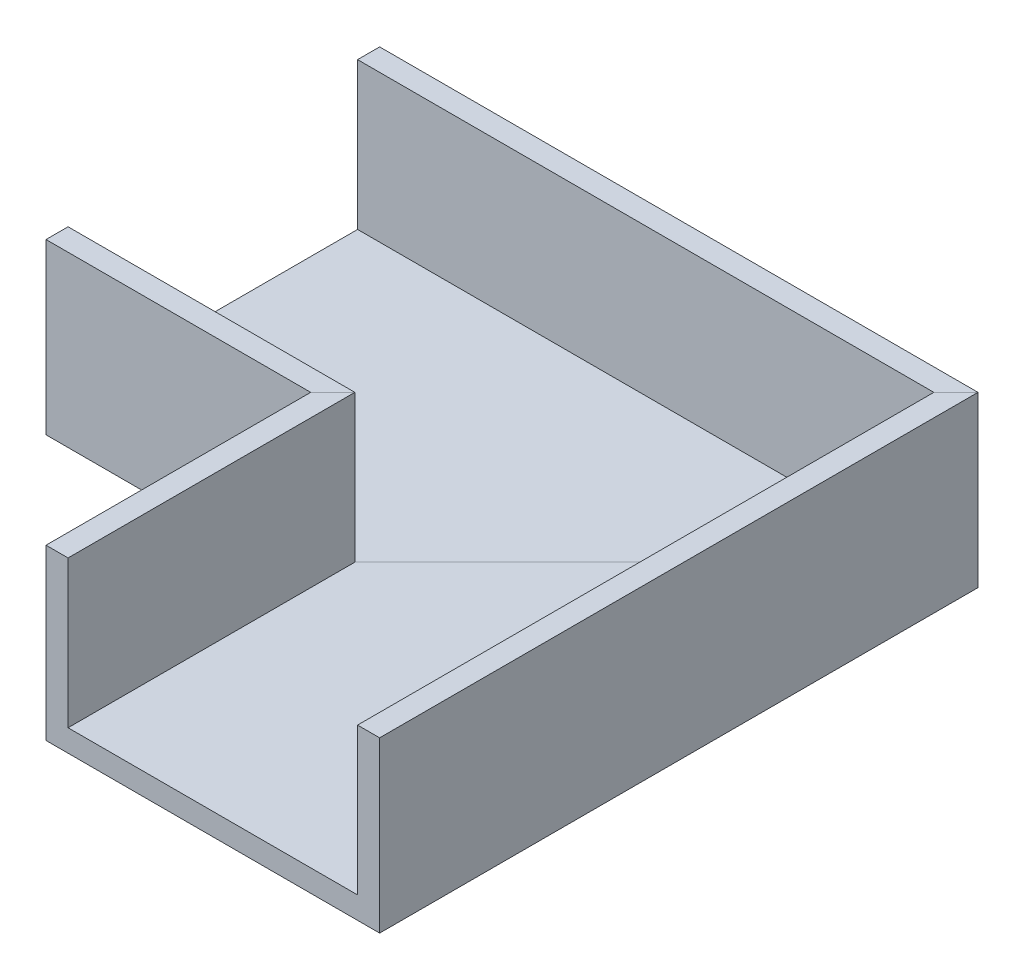
ISO-10303-21;
HEADER;
FILE_DESCRIPTION(('STEP AP214'),'2;1');
FILE_NAME('part.step','',(''),(''),'','','');
FILE_SCHEMA(('AUTOMOTIVE_DESIGN { 1 0 10303 214 1 1 1 1 }'));
ENDSEC;
DATA;
#1=APPLICATION_CONTEXT('core data for automotive mechanical design processes');
#2=APPLICATION_PROTOCOL_DEFINITION('international standard','automotive_design',2000,#1);
#3=PRODUCT_CONTEXT('',#1,'mechanical');
#4=PRODUCT('Part','Part','',(#3));
#5=PRODUCT_RELATED_PRODUCT_CATEGORY('part','',(#4));
#6=PRODUCT_DEFINITION_FORMATION('','',#4);
#7=PRODUCT_DEFINITION_CONTEXT('part definition',#1,'design');
#8=PRODUCT_DEFINITION('design','',#6,#7);
#9=PRODUCT_DEFINITION_SHAPE('','',#8);
#10=(LENGTH_UNIT() NAMED_UNIT(*) SI_UNIT(.MILLI.,.METRE.));
#11=(NAMED_UNIT(*) PLANE_ANGLE_UNIT() SI_UNIT($,.RADIAN.));
#12=(NAMED_UNIT(*) SI_UNIT($,.STERADIAN.) SOLID_ANGLE_UNIT());
#13=UNCERTAINTY_MEASURE_WITH_UNIT(LENGTH_MEASURE(1.E-05),#10,'distance_accuracy_value','');
#14=(GEOMETRIC_REPRESENTATION_CONTEXT(3) GLOBAL_UNCERTAINTY_ASSIGNED_CONTEXT((#13)) GLOBAL_UNIT_ASSIGNED_CONTEXT((#10,
#11,#12)) REPRESENTATION_CONTEXT('',''));
#15=CARTESIAN_POINT('',(0.,0.,0.));
#16=DIRECTION('',(0.,0.,1.));
#17=DIRECTION('',(1.,0.,0.));
#18=AXIS2_PLACEMENT_3D('',#15,#16,#17);
#19=CARTESIAN_POINT('',(-36.,0.,-36.));
#20=DIRECTION('',(-1.,0.,0.));
#21=DIRECTION('',(0.,0.,1.));
#22=AXIS2_PLACEMENT_3D('',#19,#20,#21);
#23=PLANE('',#22);
#24=DIRECTION('',(0.,0.,-1.));
#25=VECTOR('',#24,1.);
#26=CARTESIAN_POINT('',(-36.,0.,-81.37));
#27=LINE('',#26,#25);
#28=CARTESIAN_POINT('',(-36.,0.,-36.));
#29=VERTEX_POINT('',#28);
#30=CARTESIAN_POINT('',(-36.,0.,-81.37));
#31=VERTEX_POINT('',#30);
#32=EDGE_CURVE('E201',#29,#31,#27,.T.);
#33=ORIENTED_EDGE('',*,*,#32,.F.);
#34=DIRECTION('',(0.,-1.,0.));
#35=VECTOR('',#34,1.);
#36=CARTESIAN_POINT('',(-36.,0.,-36.));
#37=LINE('',#36,#35);
#38=CARTESIAN_POINT('',(-36.,23.,-36.));
#39=VERTEX_POINT('',#38);
#40=EDGE_CURVE('E203',#39,#29,#37,.T.);
#41=ORIENTED_EDGE('',*,*,#40,.F.);
#42=DIRECTION('',(0.,0.,1.));
#43=VECTOR('',#42,1.);
#44=CARTESIAN_POINT('',(-36.,23.,-36.));
#45=LINE('',#44,#43);
#46=CARTESIAN_POINT('',(-36.,23.,-39.));
#47=VERTEX_POINT('',#46);
#48=EDGE_CURVE('E205',#47,#39,#45,.T.);
#49=ORIENTED_EDGE('',*,*,#48,.F.);
#50=DIRECTION('',(0.,1.,0.));
#51=VECTOR('',#50,1.);
#52=CARTESIAN_POINT('',(-36.,23.,-39.));
#53=LINE('',#52,#51);
#54=CARTESIAN_POINT('',(-36.,3.,-39.));
#55=VERTEX_POINT('',#54);
#56=EDGE_CURVE('E153',#55,#47,#53,.T.);
#57=ORIENTED_EDGE('',*,*,#56,.F.);
#58=DIRECTION('',(0.,0.,1.));
#59=VECTOR('',#58,1.);
#60=CARTESIAN_POINT('',(-36.,3.,-39.));
#61=LINE('',#60,#59);
#62=CARTESIAN_POINT('',(-36.,2.99999999999999,-78.37));
#63=VERTEX_POINT('',#62);
#64=EDGE_CURVE('E208',#63,#55,#61,.T.);
#65=ORIENTED_EDGE('',*,*,#64,.F.);
#66=DIRECTION('',(0.,-1.,0.));
#67=VECTOR('',#66,1.);
#68=CARTESIAN_POINT('',(-36.,2.99999999999999,-78.37));
#69=LINE('',#68,#67);
#70=CARTESIAN_POINT('',(-36.,23.,-78.37));
#71=VERTEX_POINT('',#70);
#72=EDGE_CURVE('E210',#71,#63,#69,.T.);
#73=ORIENTED_EDGE('',*,*,#72,.F.);
#74=DIRECTION('',(0.,0.,1.));
#75=VECTOR('',#74,1.);
#76=CARTESIAN_POINT('',(-36.,23.,-78.37));
#77=LINE('',#76,#75);
#78=CARTESIAN_POINT('',(-36.,23.,-81.37));
#79=VERTEX_POINT('',#78);
#80=EDGE_CURVE('E79',#79,#71,#77,.T.);
#81=ORIENTED_EDGE('',*,*,#80,.F.);
#82=DIRECTION('',(0.,1.,0.));
#83=VECTOR('',#82,1.);
#84=CARTESIAN_POINT('',(-36.,23.,-81.37));
#85=LINE('',#84,#83);
#86=EDGE_CURVE('E87',#31,#79,#85,.T.);
#87=ORIENTED_EDGE('',*,*,#86,.F.);
#88=EDGE_LOOP('',(#33,#41,#49,#57,#65,#73,#81,#87));
#89=FACE_BOUND('',#88,.T.);
#90=ADVANCED_FACE('F33',(#89),#23,.T.);
#91=CARTESIAN_POINT('',(0.,0.,0.));
#92=DIRECTION('',(0.,0.,-1.));
#93=DIRECTION('',(-1.,0.,0.));
#94=AXIS2_PLACEMENT_3D('',#91,#92,#93);
#95=PLANE('',#94);
#96=DIRECTION('',(1.,0.,0.));
#97=VECTOR('',#96,1.);
#98=CARTESIAN_POINT('',(45.37,0.,0.));
#99=LINE('',#98,#97);
#100=CARTESIAN_POINT('',(0.,0.,0.));
#101=VERTEX_POINT('',#100);
#102=CARTESIAN_POINT('',(45.37,0.,0.));
#103=VERTEX_POINT('',#102);
#104=EDGE_CURVE('E185',#101,#103,#99,.T.);
#105=ORIENTED_EDGE('',*,*,#104,.T.);
#106=DIRECTION('',(0.,1.,0.));
#107=VECTOR('',#106,1.);
#108=CARTESIAN_POINT('',(45.37,23.,0.));
#109=LINE('',#108,#107);
#110=CARTESIAN_POINT('',(45.37,23.,0.));
#111=VERTEX_POINT('',#110);
#112=EDGE_CURVE('E191',#103,#111,#109,.T.);
#113=ORIENTED_EDGE('',*,*,#112,.T.);
#114=DIRECTION('',(-1.,0.,0.));
#115=VECTOR('',#114,1.);
#116=CARTESIAN_POINT('',(42.37,23.,0.));
#117=LINE('',#116,#115);
#118=CARTESIAN_POINT('',(42.37,23.,0.));
#119=VERTEX_POINT('',#118);
#120=EDGE_CURVE('E95',#111,#119,#117,.T.);
#121=ORIENTED_EDGE('',*,*,#120,.T.);
#122=DIRECTION('',(0.,-1.,0.));
#123=VECTOR('',#122,1.);
#124=CARTESIAN_POINT('',(42.37,2.99999999999999,0.));
#125=LINE('',#124,#123);
#126=CARTESIAN_POINT('',(42.37,2.99999999999999,0.));
#127=VERTEX_POINT('',#126);
#128=EDGE_CURVE('E225',#119,#127,#125,.T.);
#129=ORIENTED_EDGE('',*,*,#128,.T.);
#130=DIRECTION('',(-1.,0.,0.));
#131=VECTOR('',#130,1.);
#132=CARTESIAN_POINT('',(3.00000000000001,3.,0.));
#133=LINE('',#132,#131);
#134=CARTESIAN_POINT('',(3.00000000000001,3.,0.));
#135=VERTEX_POINT('',#134);
#136=EDGE_CURVE('E229',#127,#135,#133,.T.);
#137=ORIENTED_EDGE('',*,*,#136,.T.);
#138=DIRECTION('',(0.,1.,0.));
#139=VECTOR('',#138,1.);
#140=CARTESIAN_POINT('',(3.,23.,0.));
#141=LINE('',#140,#139);
#142=CARTESIAN_POINT('',(3.,23.,0.));
#143=VERTEX_POINT('',#142);
#144=EDGE_CURVE('E180',#135,#143,#141,.T.);
#145=ORIENTED_EDGE('',*,*,#144,.T.);
#146=DIRECTION('',(-1.,0.,0.));
#147=VECTOR('',#146,1.);
#148=CARTESIAN_POINT('',(0.,23.,0.));
#149=LINE('',#148,#147);
#150=CARTESIAN_POINT('',(0.,23.,0.));
#151=VERTEX_POINT('',#150);
#152=EDGE_CURVE('E169',#143,#151,#149,.T.);
#153=ORIENTED_EDGE('',*,*,#152,.T.);
#154=DIRECTION('',(0.,-1.,0.));
#155=VECTOR('',#154,1.);
#156=CARTESIAN_POINT('',(0.,0.,0.));
#157=LINE('',#156,#155);
#158=EDGE_CURVE('E181',#151,#101,#157,.T.);
#159=ORIENTED_EDGE('',*,*,#158,.T.);
#160=EDGE_LOOP('',(#105,#113,#121,#129,#137,#145,#153,#159));
#161=FACE_BOUND('',#160,.T.);
#162=ADVANCED_FACE('F240',(#161),#95,.F.);
#163=CARTESIAN_POINT('',(50.007,23.,-78.37));
#164=DIRECTION('',(0.,-1.,0.));
#165=DIRECTION('',(0.,0.,-1.));
#166=AXIS2_PLACEMENT_3D('',#163,#164,#165);
#167=PLANE('',#166);
#168=DIRECTION('',(0.707106781186547,0.,-0.707106781186548));
#169=VECTOR('',#168,1.);
#170=CARTESIAN_POINT('',(3.18499999999999,23.,-39.185));
#171=LINE('',#170,#169);
#172=CARTESIAN_POINT('',(42.37,23.,-78.37));
#173=VERTEX_POINT('',#172);
#174=CARTESIAN_POINT('',(45.37,23.,-81.37));
#175=VERTEX_POINT('',#174);
#176=EDGE_CURVE('E194',#173,#175,#171,.T.);
#177=ORIENTED_EDGE('',*,*,#176,.T.);
#178=DIRECTION('',(-1.,0.,0.));
#179=VECTOR('',#178,1.);
#180=CARTESIAN_POINT('',(50.007,23.,-81.37));
#181=LINE('',#180,#179);
#182=EDGE_CURVE('E36',#175,#79,#181,.T.);
#183=ORIENTED_EDGE('',*,*,#182,.T.);
#184=ORIENTED_EDGE('',*,*,#80,.T.);
#185=DIRECTION('',(-1.,0.,0.));
#186=VECTOR('',#185,1.);
#187=CARTESIAN_POINT('',(50.007,23.,-78.37));
#188=LINE('',#187,#186);
#189=EDGE_CURVE('E222',#173,#71,#188,.T.);
#190=ORIENTED_EDGE('',*,*,#189,.F.);
#191=EDGE_LOOP('',(#177,#183,#184,#190));
#192=FACE_BOUND('',#191,.T.);
#193=ADVANCED_FACE('F256',(#192),#167,.F.);
#194=CARTESIAN_POINT('',(50.007,2.99999999999999,-78.37));
#195=DIRECTION('',(0.,0.,-1.));
#196=DIRECTION('',(-1.,0.,0.));
#197=AXIS2_PLACEMENT_3D('',#194,#195,#196);
#198=PLANE('',#197);
#199=DIRECTION('',(0.,1.,0.));
#200=VECTOR('',#199,1.);
#201=CARTESIAN_POINT('',(42.37,2.99999999999999,-78.37));
#202=LINE('',#201,#200);
#203=CARTESIAN_POINT('',(42.37,2.99999999999999,-78.37));
#204=VERTEX_POINT('',#203);
#205=EDGE_CURVE('E11',#204,#173,#202,.T.);
#206=ORIENTED_EDGE('',*,*,#205,.T.);
#207=ORIENTED_EDGE('',*,*,#189,.T.);
#208=ORIENTED_EDGE('',*,*,#72,.T.);
#209=DIRECTION('',(-1.,0.,0.));
#210=VECTOR('',#209,1.);
#211=CARTESIAN_POINT('',(50.007,2.99999999999999,-78.37));
#212=LINE('',#211,#210);
#213=EDGE_CURVE('E220',#204,#63,#212,.T.);
#214=ORIENTED_EDGE('',*,*,#213,.F.);
#215=EDGE_LOOP('',(#206,#207,#208,#214));
#216=FACE_BOUND('',#215,.T.);
#217=ADVANCED_FACE('F257',(#216),#198,.F.);
#218=CARTESIAN_POINT('',(50.007,3.,-39.));
#219=DIRECTION('',(0.,-1.,0.));
#220=DIRECTION('',(0.,0.,-1.));
#221=AXIS2_PLACEMENT_3D('',#218,#219,#220);
#222=PLANE('',#221);
#223=DIRECTION('',(0.707106781186547,0.,-0.707106781186548));
#224=VECTOR('',#223,1.);
#225=CARTESIAN_POINT('',(-16.5,3.,-19.5));
#226=LINE('',#225,#224);
#227=CARTESIAN_POINT('',(3.,3.,-39.));
#228=VERTEX_POINT('',#227);
#229=EDGE_CURVE('E42',#228,#204,#226,.T.);
#230=ORIENTED_EDGE('',*,*,#229,.T.);
#231=ORIENTED_EDGE('',*,*,#213,.T.);
#232=ORIENTED_EDGE('',*,*,#64,.T.);
#233=DIRECTION('',(-1.,0.,0.));
#234=VECTOR('',#233,1.);
#235=CARTESIAN_POINT('',(50.007,3.,-39.));
#236=LINE('',#235,#234);
#237=EDGE_CURVE('E156',#228,#55,#236,.T.);
#238=ORIENTED_EDGE('',*,*,#237,.F.);
#239=EDGE_LOOP('',(#230,#231,#232,#238));
#240=FACE_BOUND('',#239,.T.);
#241=ADVANCED_FACE('F265',(#240),#222,.F.);
#242=CARTESIAN_POINT('',(50.007,23.,-39.));
#243=DIRECTION('',(0.,0.,1.));
#244=DIRECTION('',(0.,-1.,0.));
#245=AXIS2_PLACEMENT_3D('',#242,#243,#244);
#246=PLANE('',#245);
#247=DIRECTION('',(0.,-1.,0.));
#248=VECTOR('',#247,1.);
#249=CARTESIAN_POINT('',(3.,23.,-39.));
#250=LINE('',#249,#248);
#251=CARTESIAN_POINT('',(3.,23.,-39.));
#252=VERTEX_POINT('',#251);
#253=EDGE_CURVE('E137',#252,#228,#250,.T.);
#254=ORIENTED_EDGE('',*,*,#253,.T.);
#255=ORIENTED_EDGE('',*,*,#237,.T.);
#256=ORIENTED_EDGE('',*,*,#56,.T.);
#257=DIRECTION('',(-1.,0.,0.));
#258=VECTOR('',#257,1.);
#259=CARTESIAN_POINT('',(50.007,23.,-39.));
#260=LINE('',#259,#258);
#261=EDGE_CURVE('E149',#252,#47,#260,.T.);
#262=ORIENTED_EDGE('',*,*,#261,.F.);
#263=EDGE_LOOP('',(#254,#255,#256,#262));
#264=FACE_BOUND('',#263,.T.);
#265=ADVANCED_FACE('F151',(#264),#246,.F.);
#266=CARTESIAN_POINT('',(50.007,23.,-36.));
#267=DIRECTION('',(0.,-1.,0.));
#268=DIRECTION('',(0.,0.,-1.));
#269=AXIS2_PLACEMENT_3D('',#266,#267,#268);
#270=PLANE('',#269);
#271=DIRECTION('',(0.707106781186547,0.,-0.707106781186548));
#272=VECTOR('',#271,1.);
#273=CARTESIAN_POINT('',(-18.,23.,-18.));
#274=LINE('',#273,#272);
#275=CARTESIAN_POINT('',(0.,23.,-36.));
#276=VERTEX_POINT('',#275);
#277=EDGE_CURVE('E146',#276,#252,#274,.T.);
#278=ORIENTED_EDGE('',*,*,#277,.T.);
#279=ORIENTED_EDGE('',*,*,#261,.T.);
#280=ORIENTED_EDGE('',*,*,#48,.T.);
#281=DIRECTION('',(-1.,0.,0.));
#282=VECTOR('',#281,1.);
#283=CARTESIAN_POINT('',(50.007,23.,-36.));
#284=LINE('',#283,#282);
#285=EDGE_CURVE('E157',#276,#39,#284,.T.);
#286=ORIENTED_EDGE('',*,*,#285,.F.);
#287=EDGE_LOOP('',(#278,#279,#280,#286));
#288=FACE_BOUND('',#287,.T.);
#289=ADVANCED_FACE('F160',(#288),#270,.F.);
#290=CARTESIAN_POINT('',(50.007,0.,-36.));
#291=DIRECTION('',(0.,0.,-1.));
#292=DIRECTION('',(-1.,0.,0.));
#293=AXIS2_PLACEMENT_3D('',#290,#291,#292);
#294=PLANE('',#293);
#295=DIRECTION('',(0.,1.,0.));
#296=VECTOR('',#295,1.);
#297=CARTESIAN_POINT('',(0.,0.,-36.));
#298=LINE('',#297,#296);
#299=CARTESIAN_POINT('',(0.,0.,-36.));
#300=VERTEX_POINT('',#299);
#301=EDGE_CURVE('E165',#300,#276,#298,.T.);
#302=ORIENTED_EDGE('',*,*,#301,.T.);
#303=ORIENTED_EDGE('',*,*,#285,.T.);
#304=ORIENTED_EDGE('',*,*,#40,.T.);
#305=DIRECTION('',(-1.,0.,0.));
#306=VECTOR('',#305,1.);
#307=CARTESIAN_POINT('',(50.007,0.,-36.));
#308=LINE('',#307,#306);
#309=EDGE_CURVE('E215',#300,#29,#308,.T.);
#310=ORIENTED_EDGE('',*,*,#309,.F.);
#311=EDGE_LOOP('',(#302,#303,#304,#310));
#312=FACE_BOUND('',#311,.T.);
#313=ADVANCED_FACE('F271',(#312),#294,.F.);
#314=CARTESIAN_POINT('',(50.007,0.,-81.37));
#315=DIRECTION('',(0.,1.,0.));
#316=DIRECTION('',(0.,0.,1.));
#317=AXIS2_PLACEMENT_3D('',#314,#315,#316);
#318=PLANE('',#317);
#319=DIRECTION('',(-0.707106781186547,0.,0.707106781186548));
#320=VECTOR('',#319,1.);
#321=CARTESIAN_POINT('',(4.685,0.,-40.685));
#322=LINE('',#321,#320);
#323=CARTESIAN_POINT('',(45.37,0.,-81.37));
#324=VERTEX_POINT('',#323);
#325=EDGE_CURVE('E249',#324,#300,#322,.T.);
#326=ORIENTED_EDGE('',*,*,#325,.T.);
#327=ORIENTED_EDGE('',*,*,#309,.T.);
#328=ORIENTED_EDGE('',*,*,#32,.T.);
#329=DIRECTION('',(-1.,0.,0.));
#330=VECTOR('',#329,1.);
#331=CARTESIAN_POINT('',(50.007,0.,-81.37));
#332=LINE('',#331,#330);
#333=EDGE_CURVE('E213',#324,#31,#332,.T.);
#334=ORIENTED_EDGE('',*,*,#333,.F.);
#335=EDGE_LOOP('',(#326,#327,#328,#334));
#336=FACE_BOUND('',#335,.T.);
#337=ADVANCED_FACE('F275',(#336),#318,.F.);
#338=CARTESIAN_POINT('',(50.007,23.,-81.37));
#339=DIRECTION('',(0.,0.,1.));
#340=DIRECTION('',(0.,-1.,0.));
#341=AXIS2_PLACEMENT_3D('',#338,#339,#340);
#342=PLANE('',#341);
#343=DIRECTION('',(0.,-1.,0.));
#344=VECTOR('',#343,1.);
#345=CARTESIAN_POINT('',(45.37,23.,-81.37));
#346=LINE('',#345,#344);
#347=EDGE_CURVE('E199',#175,#324,#346,.T.);
#348=ORIENTED_EDGE('',*,*,#347,.T.);
#349=ORIENTED_EDGE('',*,*,#333,.T.);
#350=ORIENTED_EDGE('',*,*,#86,.T.);
#351=ORIENTED_EDGE('',*,*,#182,.F.);
#352=EDGE_LOOP('',(#348,#349,#350,#351));
#353=FACE_BOUND('',#352,.T.);
#354=ADVANCED_FACE('F274',(#353),#342,.F.);
#355=CARTESIAN_POINT('',(45.37,23.,0.));
#356=DIRECTION('',(-1.,0.,0.));
#357=DIRECTION('',(0.,-1.,0.));
#358=AXIS2_PLACEMENT_3D('',#355,#356,#357);
#359=PLANE('',#358);
#360=DIRECTION('',(0.,0.,-1.));
#361=VECTOR('',#360,1.);
#362=CARTESIAN_POINT('',(45.37,23.,0.));
#363=LINE('',#362,#361);
#364=EDGE_CURVE('E196',#111,#175,#363,.T.);
#365=ORIENTED_EDGE('',*,*,#364,.F.);
#366=ORIENTED_EDGE('',*,*,#112,.F.);
#367=DIRECTION('',(0.,0.,-1.));
#368=VECTOR('',#367,1.);
#369=CARTESIAN_POINT('',(45.37,0.,0.));
#370=LINE('',#369,#368);
#371=EDGE_CURVE('E188',#103,#324,#370,.T.);
#372=ORIENTED_EDGE('',*,*,#371,.T.);
#373=ORIENTED_EDGE('',*,*,#347,.F.);
#374=EDGE_LOOP('',(#365,#366,#372,#373));
#375=FACE_BOUND('',#374,.T.);
#376=ADVANCED_FACE('F253',(#375),#359,.F.);
#377=CARTESIAN_POINT('',(45.37,0.,0.));
#378=DIRECTION('',(0.,1.,0.));
#379=DIRECTION('',(-1.,0.,0.));
#380=AXIS2_PLACEMENT_3D('',#377,#378,#379);
#381=PLANE('',#380);
#382=ORIENTED_EDGE('',*,*,#371,.F.);
#383=ORIENTED_EDGE('',*,*,#104,.F.);
#384=DIRECTION('',(0.,0.,-1.));
#385=VECTOR('',#384,1.);
#386=CARTESIAN_POINT('',(0.,0.,0.));
#387=LINE('',#386,#385);
#388=EDGE_CURVE('E174',#101,#300,#387,.T.);
#389=ORIENTED_EDGE('',*,*,#388,.T.);
#390=ORIENTED_EDGE('',*,*,#325,.F.);
#391=EDGE_LOOP('',(#382,#383,#389,#390));
#392=FACE_BOUND('',#391,.T.);
#393=ADVANCED_FACE('F247',(#392),#381,.F.);
#394=CARTESIAN_POINT('',(0.,0.,0.));
#395=DIRECTION('',(1.,0.,0.));
#396=DIRECTION('',(0.,0.,-1.));
#397=AXIS2_PLACEMENT_3D('',#394,#395,#396);
#398=PLANE('',#397);
#399=ORIENTED_EDGE('',*,*,#388,.F.);
#400=ORIENTED_EDGE('',*,*,#158,.F.);
#401=DIRECTION('',(0.,0.,-1.));
#402=VECTOR('',#401,1.);
#403=CARTESIAN_POINT('',(0.,23.,0.));
#404=LINE('',#403,#402);
#405=EDGE_CURVE('E171',#151,#276,#404,.T.);
#406=ORIENTED_EDGE('',*,*,#405,.T.);
#407=ORIENTED_EDGE('',*,*,#301,.F.);
#408=EDGE_LOOP('',(#399,#400,#406,#407));
#409=FACE_BOUND('',#408,.T.);
#410=ADVANCED_FACE('F243',(#409),#398,.F.);
#411=CARTESIAN_POINT('',(0.,23.,0.));
#412=DIRECTION('',(0.,-1.,0.));
#413=DIRECTION('',(0.,0.,-1.));
#414=AXIS2_PLACEMENT_3D('',#411,#412,#413);
#415=PLANE('',#414);
#416=ORIENTED_EDGE('',*,*,#405,.F.);
#417=ORIENTED_EDGE('',*,*,#152,.F.);
#418=DIRECTION('',(0.,0.,-1.));
#419=VECTOR('',#418,1.);
#420=CARTESIAN_POINT('',(3.,23.,0.));
#421=LINE('',#420,#419);
#422=EDGE_CURVE('E141',#143,#252,#421,.T.);
#423=ORIENTED_EDGE('',*,*,#422,.T.);
#424=ORIENTED_EDGE('',*,*,#277,.F.);
#425=EDGE_LOOP('',(#416,#417,#423,#424));
#426=FACE_BOUND('',#425,.T.);
#427=ADVANCED_FACE('F167',(#426),#415,.F.);
#428=CARTESIAN_POINT('',(3.,23.,0.));
#429=DIRECTION('',(-1.,0.,0.));
#430=DIRECTION('',(0.,-1.,0.));
#431=AXIS2_PLACEMENT_3D('',#428,#429,#430);
#432=PLANE('',#431);
#433=ORIENTED_EDGE('',*,*,#422,.F.);
#434=ORIENTED_EDGE('',*,*,#144,.F.);
#435=DIRECTION('',(0.,0.,-1.));
#436=VECTOR('',#435,1.);
#437=CARTESIAN_POINT('',(3.00000000000001,3.,0.));
#438=LINE('',#437,#436);
#439=EDGE_CURVE('E143',#135,#228,#438,.T.);
#440=ORIENTED_EDGE('',*,*,#439,.T.);
#441=ORIENTED_EDGE('',*,*,#253,.F.);
#442=EDGE_LOOP('',(#433,#434,#440,#441));
#443=FACE_BOUND('',#442,.T.);
#444=ADVANCED_FACE('F139',(#443),#432,.F.);
#445=CARTESIAN_POINT('',(3.00000000000001,3.,0.));
#446=DIRECTION('',(0.,-1.,0.));
#447=DIRECTION('',(1.,0.,0.));
#448=AXIS2_PLACEMENT_3D('',#445,#446,#447);
#449=PLANE('',#448);
#450=ORIENTED_EDGE('',*,*,#439,.F.);
#451=ORIENTED_EDGE('',*,*,#136,.F.);
#452=DIRECTION('',(0.,0.,-1.));
#453=VECTOR('',#452,1.);
#454=CARTESIAN_POINT('',(42.37,2.99999999999999,0.));
#455=LINE('',#454,#453);
#456=EDGE_CURVE('E176',#127,#204,#455,.T.);
#457=ORIENTED_EDGE('',*,*,#456,.T.);
#458=ORIENTED_EDGE('',*,*,#229,.F.);
#459=EDGE_LOOP('',(#450,#451,#457,#458));
#460=FACE_BOUND('',#459,.T.);
#461=ADVANCED_FACE('F261',(#460),#449,.F.);
#462=CARTESIAN_POINT('',(42.37,2.99999999999999,0.));
#463=DIRECTION('',(1.,0.,0.));
#464=DIRECTION('',(0.,0.,-1.));
#465=AXIS2_PLACEMENT_3D('',#462,#463,#464);
#466=PLANE('',#465);
#467=ORIENTED_EDGE('',*,*,#456,.F.);
#468=ORIENTED_EDGE('',*,*,#128,.F.);
#469=DIRECTION('',(0.,0.,-1.));
#470=VECTOR('',#469,1.);
#471=CARTESIAN_POINT('',(42.37,23.,0.));
#472=LINE('',#471,#470);
#473=EDGE_CURVE('E234',#119,#173,#472,.T.);
#474=ORIENTED_EDGE('',*,*,#473,.T.);
#475=ORIENTED_EDGE('',*,*,#205,.F.);
#476=EDGE_LOOP('',(#467,#468,#474,#475));
#477=FACE_BOUND('',#476,.T.);
#478=ADVANCED_FACE('F259',(#477),#466,.F.);
#479=CARTESIAN_POINT('',(42.37,23.,0.));
#480=DIRECTION('',(0.,-1.,0.));
#481=DIRECTION('',(0.,0.,-1.));
#482=AXIS2_PLACEMENT_3D('',#479,#480,#481);
#483=PLANE('',#482);
#484=ORIENTED_EDGE('',*,*,#473,.F.);
#485=ORIENTED_EDGE('',*,*,#120,.F.);
#486=ORIENTED_EDGE('',*,*,#364,.T.);
#487=ORIENTED_EDGE('',*,*,#176,.F.);
#488=EDGE_LOOP('',(#484,#485,#486,#487));
#489=FACE_BOUND('',#488,.T.);
#490=ADVANCED_FACE('F255',(#489),#483,.F.);
#491=CLOSED_SHELL('',(#90,#162,#193,#217,#241,#265,#289,#313,#337,#354,#376,#393,#410,#427,#444,
#461,#478,#490));
#492=MANIFOLD_SOLID_BREP('B2',#491);
#493=ADVANCED_BREP_SHAPE_REPRESENTATION('',(#18,#492),#14);
#494=SHAPE_DEFINITION_REPRESENTATION(#9,#493);
ENDSEC;
END-ISO-10303-21;
